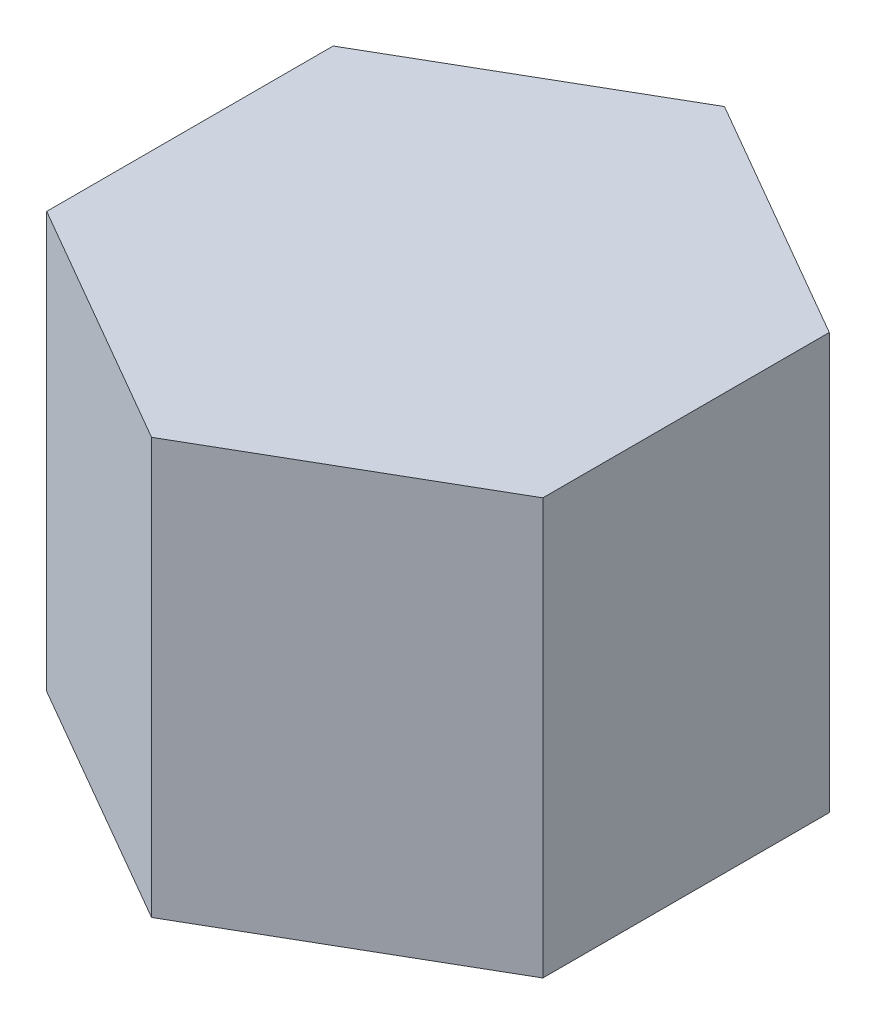
ISO-10303-21;
HEADER;
FILE_DESCRIPTION(('STEP AP214'),'2;1');
FILE_NAME('part.step','',(''),(''),'','','');
FILE_SCHEMA(('AUTOMOTIVE_DESIGN { 1 0 10303 214 1 1 1 1 }'));
ENDSEC;
DATA;
#1=APPLICATION_CONTEXT('core data for automotive mechanical design processes');
#2=APPLICATION_PROTOCOL_DEFINITION('international standard','automotive_design',2000,#1);
#3=PRODUCT_CONTEXT('',#1,'mechanical');
#4=PRODUCT('Part','Part','',(#3));
#5=PRODUCT_RELATED_PRODUCT_CATEGORY('part','',(#4));
#6=PRODUCT_DEFINITION_FORMATION('','',#4);
#7=PRODUCT_DEFINITION_CONTEXT('part definition',#1,'design');
#8=PRODUCT_DEFINITION('design','',#6,#7);
#9=PRODUCT_DEFINITION_SHAPE('','',#8);
#10=(LENGTH_UNIT() NAMED_UNIT(*) SI_UNIT(.MILLI.,.METRE.));
#11=(NAMED_UNIT(*) PLANE_ANGLE_UNIT() SI_UNIT($,.RADIAN.));
#12=(NAMED_UNIT(*) SI_UNIT($,.STERADIAN.) SOLID_ANGLE_UNIT());
#13=UNCERTAINTY_MEASURE_WITH_UNIT(LENGTH_MEASURE(1.E-05),#10,'distance_accuracy_value','');
#14=(GEOMETRIC_REPRESENTATION_CONTEXT(3) GLOBAL_UNCERTAINTY_ASSIGNED_CONTEXT((#13)) GLOBAL_UNIT_ASSIGNED_CONTEXT((#10,
#11,#12)) REPRESENTATION_CONTEXT('',''));
#15=CARTESIAN_POINT('',(0.,0.,0.));
#16=DIRECTION('',(0.,0.,1.));
#17=DIRECTION('',(1.,0.,0.));
#18=AXIS2_PLACEMENT_3D('',#15,#16,#17);
#19=CARTESIAN_POINT('',(210.142660308706,-148.537700895744,287.176844201572));
#20=DIRECTION('',(-0.499999999999943,0.,-0.866025403784472));
#21=DIRECTION('',(-0.866025403784472,0.,0.499999999999943));
#22=AXIS2_PLACEMENT_3D('',#19,#20,#21);
#23=PLANE('',#22);
#24=CARTESIAN_POINT('',(209.839551417382,-149.045793579175,287.351844201572));
#25=DIRECTION('',(0.866025403784471,0.,-0.499999999999943));
#26=VECTOR('',#25,1.);
#27=LINE('',#24,#26);
#28=CARTESIAN_POINT('',(209.839551417382,-149.045793579175,287.351844201572));
#29=VERTEX_POINT('',#28);
#30=CARTESIAN_POINT('',(210.142660308706,-149.045793579175,287.176844201572));
#31=VERTEX_POINT('',#30);
#32=EDGE_CURVE('E170',#29,#31,#27,.T.);
#33=ORIENTED_EDGE('',*,*,#32,.T.);
#34=CARTESIAN_POINT('',(210.142660308706,-148.537700895744,287.176844201572));
#35=DIRECTION('',(0.,-1.,0.));
#36=VECTOR('',#35,1.);
#37=LINE('',#34,#36);
#38=CARTESIAN_POINT('',(210.142660308706,-148.537700895744,287.176844201572));
#39=VERTEX_POINT('',#38);
#40=EDGE_CURVE('E35',#39,#31,#37,.T.);
#41=ORIENTED_EDGE('',*,*,#40,.F.);
#42=CARTESIAN_POINT('',(209.839551417382,-148.537700895744,287.351844201572));
#43=DIRECTION('',(0.866025403784471,0.,-0.499999999999943));
#44=VECTOR('',#43,1.);
#45=LINE('',#42,#44);
#46=CARTESIAN_POINT('',(209.839551417382,-148.537700895744,287.351844201572));
#47=VERTEX_POINT('',#46);
#48=EDGE_CURVE('E159',#47,#39,#45,.T.);
#49=ORIENTED_EDGE('',*,*,#48,.F.);
#50=CARTESIAN_POINT('',(209.839551417382,-148.537700895744,287.351844201572));
#51=DIRECTION('',(0.,-1.,0.));
#52=VECTOR('',#51,1.);
#53=LINE('',#50,#52);
#54=EDGE_CURVE('E10',#47,#29,#53,.T.);
#55=ORIENTED_EDGE('',*,*,#54,.T.);
#56=EDGE_LOOP('',(#33,#41,#49,#55));
#57=FACE_BOUND('',#56,.T.);
#58=ADVANCED_FACE('F16',(#57),#23,.F.);
#59=CARTESIAN_POINT('',(209.839551417382,-148.537700895744,287.351844201572));
#60=DIRECTION('',(0.500000000000062,0.,-0.866025403784403));
#61=DIRECTION('',(-0.866025403784403,0.,-0.500000000000062));
#62=AXIS2_PLACEMENT_3D('',#59,#60,#61);
#63=PLANE('',#62);
#64=CARTESIAN_POINT('',(209.536442526057,-149.045793579175,287.176844201572));
#65=DIRECTION('',(0.866025403784403,0.,0.500000000000062));
#66=VECTOR('',#65,1.);
#67=LINE('',#64,#66);
#68=CARTESIAN_POINT('',(209.536442526057,-149.045793579175,287.176844201572));
#69=VERTEX_POINT('',#68);
#70=EDGE_CURVE('E167',#69,#29,#67,.T.);
#71=ORIENTED_EDGE('',*,*,#70,.T.);
#72=ORIENTED_EDGE('',*,*,#54,.F.);
#73=CARTESIAN_POINT('',(209.536442526057,-148.537700895744,287.176844201572));
#74=DIRECTION('',(0.866025403784403,0.,0.500000000000062));
#75=VECTOR('',#74,1.);
#76=LINE('',#73,#75);
#77=CARTESIAN_POINT('',(209.536442526057,-148.537700895744,287.176844201572));
#78=VERTEX_POINT('',#77);
#79=EDGE_CURVE('E156',#78,#47,#76,.T.);
#80=ORIENTED_EDGE('',*,*,#79,.F.);
#81=CARTESIAN_POINT('',(209.536442526057,-148.537700895744,287.176844201572));
#82=DIRECTION('',(0.,-1.,0.));
#83=VECTOR('',#82,1.);
#84=LINE('',#81,#83);
#85=EDGE_CURVE('E27',#78,#69,#84,.T.);
#86=ORIENTED_EDGE('',*,*,#85,.T.);
#87=EDGE_LOOP('',(#71,#72,#80,#86));
#88=FACE_BOUND('',#87,.T.);
#89=ADVANCED_FACE('F189',(#88),#63,.F.);
#90=CARTESIAN_POINT('',(209.536442526057,-148.537700895744,290.831971220494));
#91=DIRECTION('',(1.,0.,0.));
#92=DIRECTION('',(0.,1.,0.));
#93=AXIS2_PLACEMENT_3D('',#90,#91,#92);
#94=PLANE('',#93);
#95=CARTESIAN_POINT('',(209.536442526057,-149.045793579175,286.826844201572));
#96=DIRECTION('',(0.,0.,1.));
#97=VECTOR('',#96,1.);
#98=LINE('',#95,#97);
#99=CARTESIAN_POINT('',(209.536442526057,-149.045793579175,286.826844201572));
#100=VERTEX_POINT('',#99);
#101=EDGE_CURVE('E163',#100,#69,#98,.T.);
#102=ORIENTED_EDGE('',*,*,#101,.T.);
#103=ORIENTED_EDGE('',*,*,#85,.F.);
#104=CARTESIAN_POINT('',(209.536442526057,-148.537700895744,286.826844201572));
#105=DIRECTION('',(0.,0.,1.));
#106=VECTOR('',#105,1.);
#107=LINE('',#104,#106);
#108=CARTESIAN_POINT('',(209.536442526057,-148.537700895744,286.826844201572));
#109=VERTEX_POINT('',#108);
#110=EDGE_CURVE('E106',#109,#78,#107,.T.);
#111=ORIENTED_EDGE('',*,*,#110,.F.);
#112=CARTESIAN_POINT('',(209.536442526057,-148.537700895744,286.826844201572));
#113=DIRECTION('',(0.,-1.,0.));
#114=VECTOR('',#113,1.);
#115=LINE('',#112,#114);
#116=EDGE_CURVE('E94',#109,#100,#115,.T.);
#117=ORIENTED_EDGE('',*,*,#116,.T.);
#118=EDGE_LOOP('',(#102,#103,#111,#117));
#119=FACE_BOUND('',#118,.T.);
#120=ADVANCED_FACE('F198',(#119),#94,.F.);
#121=CARTESIAN_POINT('',(209.536442526057,-148.537700895744,286.826844201572));
#122=DIRECTION('',(0.499999999999978,0.,0.866025403784452));
#123=DIRECTION('',(0.866025403784452,0.,-0.499999999999978));
#124=AXIS2_PLACEMENT_3D('',#121,#122,#123);
#125=PLANE('',#124);
#126=CARTESIAN_POINT('',(209.839551417382,-149.045793579175,286.651844201572));
#127=DIRECTION('',(-0.866025403784452,0.,0.499999999999978));
#128=VECTOR('',#127,1.);
#129=LINE('',#126,#128);
#130=CARTESIAN_POINT('',(209.839551417382,-149.045793579175,286.651844201572));
#131=VERTEX_POINT('',#130);
#132=EDGE_CURVE('E162',#131,#100,#129,.T.);
#133=ORIENTED_EDGE('',*,*,#132,.T.);
#134=ORIENTED_EDGE('',*,*,#116,.F.);
#135=CARTESIAN_POINT('',(209.839551417382,-148.537700895744,286.651844201572));
#136=DIRECTION('',(-0.866025403784452,0.,0.499999999999978));
#137=VECTOR('',#136,1.);
#138=LINE('',#135,#137);
#139=CARTESIAN_POINT('',(209.839551417382,-148.537700895744,286.651844201572));
#140=VERTEX_POINT('',#139);
#141=EDGE_CURVE('E98',#140,#109,#138,.T.);
#142=ORIENTED_EDGE('',*,*,#141,.F.);
#143=CARTESIAN_POINT('',(209.839551417382,-148.537700895744,286.651844201572));
#144=DIRECTION('',(0.,-1.,0.));
#145=VECTOR('',#144,1.);
#146=LINE('',#143,#145);
#147=EDGE_CURVE('E79',#140,#131,#146,.T.);
#148=ORIENTED_EDGE('',*,*,#147,.T.);
#149=EDGE_LOOP('',(#133,#134,#142,#148));
#150=FACE_BOUND('',#149,.T.);
#151=ADVANCED_FACE('F100',(#150),#125,.F.);
#152=CARTESIAN_POINT('',(209.839551417382,-148.537700895744,286.651844201572));
#153=DIRECTION('',(-0.499999999999943,0.,0.866025403784472));
#154=DIRECTION('',(0.866025403784472,0.,0.499999999999943));
#155=AXIS2_PLACEMENT_3D('',#152,#153,#154);
#156=PLANE('',#155);
#157=CARTESIAN_POINT('',(210.142660308706,-149.045793579175,286.826844201572));
#158=DIRECTION('',(-0.866025403784471,0.,-0.499999999999943));
#159=VECTOR('',#158,1.);
#160=LINE('',#157,#159);
#161=CARTESIAN_POINT('',(210.142660308706,-149.045793579175,286.826844201572));
#162=VERTEX_POINT('',#161);
#163=EDGE_CURVE('E88',#162,#131,#160,.T.);
#164=ORIENTED_EDGE('',*,*,#163,.T.);
#165=ORIENTED_EDGE('',*,*,#147,.F.);
#166=CARTESIAN_POINT('',(210.142660308706,-148.537700895744,286.826844201572));
#167=DIRECTION('',(-0.866025403784471,0.,-0.499999999999943));
#168=VECTOR('',#167,1.);
#169=LINE('',#166,#168);
#170=CARTESIAN_POINT('',(210.142660308706,-148.537700895744,286.826844201572));
#171=VERTEX_POINT('',#170);
#172=EDGE_CURVE('E84',#171,#140,#169,.T.);
#173=ORIENTED_EDGE('',*,*,#172,.F.);
#174=CARTESIAN_POINT('',(210.142660308706,-148.537700895744,286.826844201572));
#175=DIRECTION('',(0.,-1.,0.));
#176=VECTOR('',#175,1.);
#177=LINE('',#174,#176);
#178=EDGE_CURVE('E58',#171,#162,#177,.T.);
#179=ORIENTED_EDGE('',*,*,#178,.T.);
#180=EDGE_LOOP('',(#164,#165,#173,#179));
#181=FACE_BOUND('',#180,.T.);
#182=ADVANCED_FACE('F82',(#181),#156,.F.);
#183=CARTESIAN_POINT('',(210.142660308706,-148.537700895744,290.831971220494));
#184=DIRECTION('',(-1.,0.,0.));
#185=DIRECTION('',(0.,-1.,0.));
#186=AXIS2_PLACEMENT_3D('',#183,#184,#185);
#187=PLANE('',#186);
#188=CARTESIAN_POINT('',(210.142660308706,-149.045793579175,287.176844201572));
#189=DIRECTION('',(0.,0.,-1.));
#190=VECTOR('',#189,1.);
#191=LINE('',#188,#190);
#192=EDGE_CURVE('E160',#31,#162,#191,.T.);
#193=ORIENTED_EDGE('',*,*,#192,.T.);
#194=ORIENTED_EDGE('',*,*,#178,.F.);
#195=CARTESIAN_POINT('',(210.142660308706,-148.537700895744,287.176844201572));
#196=DIRECTION('',(0.,0.,-1.));
#197=VECTOR('',#196,1.);
#198=LINE('',#195,#197);
#199=EDGE_CURVE('E112',#39,#171,#198,.T.);
#200=ORIENTED_EDGE('',*,*,#199,.F.);
#201=ORIENTED_EDGE('',*,*,#40,.T.);
#202=EDGE_LOOP('',(#193,#194,#200,#201));
#203=FACE_BOUND('',#202,.T.);
#204=ADVANCED_FACE('F131',(#203),#187,.F.);
#205=CARTESIAN_POINT('',(206.339551417382,-148.537700895744,290.831971220494));
#206=DIRECTION('',(0.,-1.,0.));
#207=DIRECTION('',(1.,0.,0.));
#208=AXIS2_PLACEMENT_3D('',#205,#206,#207);
#209=PLANE('',#208);
#210=ORIENTED_EDGE('',*,*,#48,.T.);
#211=ORIENTED_EDGE('',*,*,#199,.T.);
#212=ORIENTED_EDGE('',*,*,#172,.T.);
#213=ORIENTED_EDGE('',*,*,#141,.T.);
#214=ORIENTED_EDGE('',*,*,#110,.T.);
#215=ORIENTED_EDGE('',*,*,#79,.T.);
#216=EDGE_LOOP('',(#210,#211,#212,#213,#214,#215));
#217=FACE_BOUND('',#216,.T.);
#218=ADVANCED_FACE('F111',(#217),#209,.F.);
#219=CARTESIAN_POINT('',(206.339551417382,-149.045793579175,290.831971220494));
#220=DIRECTION('',(0.,-1.,0.));
#221=DIRECTION('',(1.,0.,0.));
#222=AXIS2_PLACEMENT_3D('',#219,#220,#221);
#223=PLANE('',#222);
#224=ORIENTED_EDGE('',*,*,#32,.F.);
#225=ORIENTED_EDGE('',*,*,#70,.F.);
#226=ORIENTED_EDGE('',*,*,#101,.F.);
#227=ORIENTED_EDGE('',*,*,#132,.F.);
#228=ORIENTED_EDGE('',*,*,#163,.F.);
#229=ORIENTED_EDGE('',*,*,#192,.F.);
#230=EDGE_LOOP('',(#224,#225,#226,#227,#228,#229));
#231=FACE_BOUND('',#230,.T.);
#232=ADVANCED_FACE('F130',(#231),#223,.T.);
#233=CLOSED_SHELL('',(#58,#89,#120,#151,#182,#204,#218,#232));
#234=MANIFOLD_SOLID_BREP('B1',#233);
#235=ADVANCED_BREP_SHAPE_REPRESENTATION('',(#18,#234),#14);
#236=SHAPE_DEFINITION_REPRESENTATION(#9,#235);
ENDSEC;
END-ISO-10303-21;
